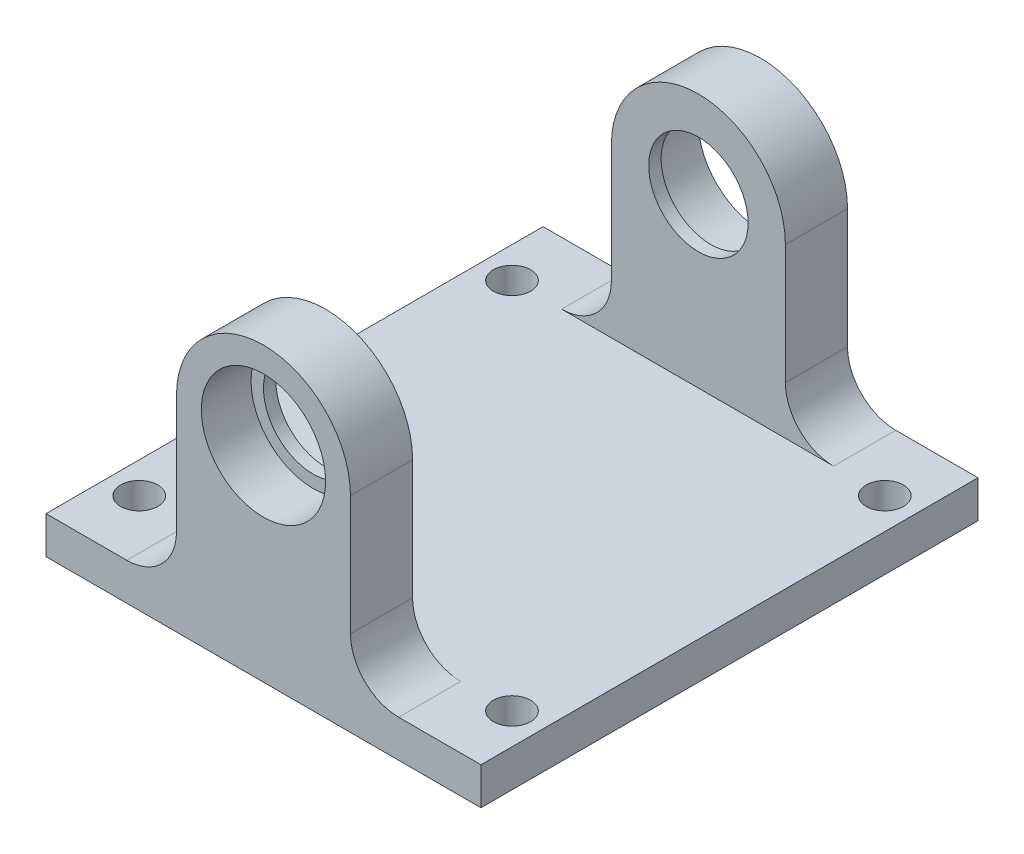
ISO-10303-21;
HEADER;
FILE_DESCRIPTION(('STEP AP214'),'2;1');
FILE_NAME('part.step','',(''),(''),'','','');
FILE_SCHEMA(('AUTOMOTIVE_DESIGN { 1 0 10303 214 1 1 1 1 }'));
ENDSEC;
DATA;
#1=APPLICATION_CONTEXT('core data for automotive mechanical design processes');
#2=APPLICATION_PROTOCOL_DEFINITION('international standard','automotive_design',2000,#1);
#3=PRODUCT_CONTEXT('',#1,'mechanical');
#4=PRODUCT('Part','Part','',(#3));
#5=PRODUCT_RELATED_PRODUCT_CATEGORY('part','',(#4));
#6=PRODUCT_DEFINITION_FORMATION('','',#4);
#7=PRODUCT_DEFINITION_CONTEXT('part definition',#1,'design');
#8=PRODUCT_DEFINITION('design','',#6,#7);
#9=PRODUCT_DEFINITION_SHAPE('','',#8);
#10=(LENGTH_UNIT() NAMED_UNIT(*) SI_UNIT(.MILLI.,.METRE.));
#11=(NAMED_UNIT(*) PLANE_ANGLE_UNIT() SI_UNIT($,.RADIAN.));
#12=(NAMED_UNIT(*) SI_UNIT($,.STERADIAN.) SOLID_ANGLE_UNIT());
#13=UNCERTAINTY_MEASURE_WITH_UNIT(LENGTH_MEASURE(1.E-05),#10,'distance_accuracy_value','');
#14=(GEOMETRIC_REPRESENTATION_CONTEXT(3) GLOBAL_UNCERTAINTY_ASSIGNED_CONTEXT((#13)) GLOBAL_UNIT_ASSIGNED_CONTEXT((#10,
#11,#12)) REPRESENTATION_CONTEXT('',''));
#15=CARTESIAN_POINT('',(0.,0.,0.));
#16=DIRECTION('',(0.,0.,1.));
#17=DIRECTION('',(1.,0.,0.));
#18=AXIS2_PLACEMENT_3D('',#15,#16,#17);
#19=CARTESIAN_POINT('',(17.5,16.5,-69.9837565929382));
#20=DIRECTION('',(0.,0.,1.));
#21=DIRECTION('',(1.,0.,0.));
#22=AXIS2_PLACEMENT_3D('',#19,#20,#21);
#23=CYLINDRICAL_SURFACE('',#22,5.);
#24=CARTESIAN_POINT('',(17.5,16.5,0.));
#25=DIRECTION('',(0.,0.,1.));
#26=DIRECTION('',(1.,0.,0.));
#27=AXIS2_PLACEMENT_3D('',#24,#25,#26);
#28=CIRCLE('',#27,5.);
#29=CARTESIAN_POINT('',(22.5,16.5,0.));
#30=VERTEX_POINT('',#29);
#31=EDGE_CURVE('E332',#30,#30,#28,.T.);
#32=ORIENTED_EDGE('',*,*,#31,.T.);
#33=EDGE_LOOP('',(#32));
#34=FACE_BOUND('',#33,.T.);
#35=CARTESIAN_POINT('',(17.5,16.5,-4.));
#36=DIRECTION('',(0.,0.,-1.));
#37=DIRECTION('',(-1.,0.,0.));
#38=AXIS2_PLACEMENT_3D('',#35,#36,#37);
#39=CIRCLE('',#38,5.);
#40=CARTESIAN_POINT('',(12.5,16.5,-4.));
#41=VERTEX_POINT('',#40);
#42=EDGE_CURVE('E11',#41,#41,#39,.F.);
#43=ORIENTED_EDGE('',*,*,#42,.F.);
#44=EDGE_LOOP('',(#43));
#45=FACE_BOUND('',#44,.T.);
#46=ADVANCED_FACE('F32',(#34,#45),#23,.F.);
#47=CARTESIAN_POINT('',(17.5,16.5,-40.));
#48=DIRECTION('',(0.,0.,1.));
#49=DIRECTION('',(1.,0.,0.));
#50=AXIS2_PLACEMENT_3D('',#47,#48,#49);
#51=CIRCLE('',#50,5.);
#52=CARTESIAN_POINT('',(22.5,16.5,-40.));
#53=VERTEX_POINT('',#52);
#54=EDGE_CURVE('E193',#53,#53,#51,.F.);
#55=ORIENTED_EDGE('',*,*,#54,.T.);
#56=EDGE_LOOP('',(#55));
#57=FACE_BOUND('',#56,.T.);
#58=CARTESIAN_POINT('',(17.5,16.5,-36.));
#59=DIRECTION('',(0.,0.,1.));
#60=DIRECTION('',(1.,0.,0.));
#61=AXIS2_PLACEMENT_3D('',#58,#59,#60);
#62=CIRCLE('',#61,5.);
#63=CARTESIAN_POINT('',(22.5,16.5,-36.));
#64=VERTEX_POINT('',#63);
#65=EDGE_CURVE('E40',#64,#64,#62,.F.);
#66=ORIENTED_EDGE('',*,*,#65,.F.);
#67=EDGE_LOOP('',(#66));
#68=FACE_BOUND('',#67,.T.);
#69=ADVANCED_FACE('F256',(#57,#68),#23,.F.);
#70=CARTESIAN_POINT('',(10.5,16.5,-69.9837565929382));
#71=DIRECTION('',(-1.,0.,0.));
#72=DIRECTION('',(0.,0.,1.));
#73=AXIS2_PLACEMENT_3D('',#70,#71,#72);
#74=PLANE('',#73);
#75=DIRECTION('',(0.,0.,1.));
#76=VECTOR('',#75,1.);
#77=CARTESIAN_POINT('',(10.5,16.5,-69.9837565929382));
#78=LINE('',#77,#76);
#79=CARTESIAN_POINT('',(10.5,16.5,-5.));
#80=VERTEX_POINT('',#79);
#81=CARTESIAN_POINT('',(10.5,16.5,0.));
#82=VERTEX_POINT('',#81);
#83=EDGE_CURVE('E192',#80,#82,#78,.T.);
#84=ORIENTED_EDGE('',*,*,#83,.F.);
#85=DIRECTION('',(0.,-1.,0.));
#86=VECTOR('',#85,1.);
#87=CARTESIAN_POINT('',(10.5,16.5,-5.));
#88=LINE('',#87,#86);
#89=CARTESIAN_POINT('',(10.5,7.00000000000003,-5.));
#90=VERTEX_POINT('',#89);
#91=EDGE_CURVE('E339',#80,#90,#88,.T.);
#92=ORIENTED_EDGE('',*,*,#91,.T.);
#93=DIRECTION('',(0.,0.,1.));
#94=VECTOR('',#93,1.);
#95=CARTESIAN_POINT('',(10.5,7.00000000000003,-69.9837565929382));
#96=LINE('',#95,#94);
#97=CARTESIAN_POINT('',(10.5,7.00000000000003,0.));
#98=VERTEX_POINT('',#97);
#99=EDGE_CURVE('E188',#90,#98,#96,.T.);
#100=ORIENTED_EDGE('',*,*,#99,.T.);
#101=DIRECTION('',(0.,-1.,0.));
#102=VECTOR('',#101,1.);
#103=CARTESIAN_POINT('',(10.5,16.5,0.));
#104=LINE('',#103,#102);
#105=EDGE_CURVE('E337',#82,#98,#104,.T.);
#106=ORIENTED_EDGE('',*,*,#105,.F.);
#107=EDGE_LOOP('',(#84,#92,#100,#106));
#108=FACE_BOUND('',#107,.T.);
#109=ADVANCED_FACE('F258',(#108),#74,.T.);
#110=CARTESIAN_POINT('',(10.5,7.00000000000003,-40.));
#111=VERTEX_POINT('',#110);
#112=CARTESIAN_POINT('',(10.5,7.00000000000003,-35.));
#113=VERTEX_POINT('',#112);
#114=EDGE_CURVE('E185',#111,#113,#96,.T.);
#115=ORIENTED_EDGE('',*,*,#114,.T.);
#116=DIRECTION('',(0.,1.,0.));
#117=VECTOR('',#116,1.);
#118=CARTESIAN_POINT('',(10.5,16.5,-35.));
#119=LINE('',#118,#117);
#120=CARTESIAN_POINT('',(10.5,16.5,-35.));
#121=VERTEX_POINT('',#120);
#122=EDGE_CURVE('E170',#113,#121,#119,.T.);
#123=ORIENTED_EDGE('',*,*,#122,.T.);
#124=CARTESIAN_POINT('',(10.5,16.5,-40.));
#125=VERTEX_POINT('',#124);
#126=EDGE_CURVE('E189',#125,#121,#78,.T.);
#127=ORIENTED_EDGE('',*,*,#126,.F.);
#128=DIRECTION('',(0.,1.,0.));
#129=VECTOR('',#128,1.);
#130=CARTESIAN_POINT('',(10.5,16.5,-40.));
#131=LINE('',#130,#129);
#132=EDGE_CURVE('E197',#111,#125,#131,.T.);
#133=ORIENTED_EDGE('',*,*,#132,.F.);
#134=EDGE_LOOP('',(#115,#123,#127,#133));
#135=FACE_BOUND('',#134,.T.);
#136=ADVANCED_FACE('F265',(#135),#74,.T.);
#137=CARTESIAN_POINT('',(6.5,7.,-69.9837565929382));
#138=DIRECTION('',(0.,0.,1.));
#139=DIRECTION('',(1.,0.,0.));
#140=AXIS2_PLACEMENT_3D('',#137,#138,#139);
#141=CYLINDRICAL_SURFACE('',#140,4.);
#142=ORIENTED_EDGE('',*,*,#99,.F.);
#143=CARTESIAN_POINT('',(6.5,7.,-5.));
#144=DIRECTION('',(0.,0.,-1.));
#145=DIRECTION('',(-1.,0.,0.));
#146=AXIS2_PLACEMENT_3D('',#143,#144,#145);
#147=CIRCLE('',#146,4.);
#148=CARTESIAN_POINT('',(6.5,3.,-5.));
#149=VERTEX_POINT('',#148);
#150=EDGE_CURVE('E334',#90,#149,#147,.T.);
#151=ORIENTED_EDGE('',*,*,#150,.T.);
#152=DIRECTION('',(0.,0.,1.));
#153=VECTOR('',#152,1.);
#154=CARTESIAN_POINT('',(6.49999999999997,3.,-69.9837565929382));
#155=LINE('',#154,#153);
#156=CARTESIAN_POINT('',(6.49999999999997,3.,0.));
#157=VERTEX_POINT('',#156);
#158=EDGE_CURVE('E55',#149,#157,#155,.T.);
#159=ORIENTED_EDGE('',*,*,#158,.T.);
#160=CARTESIAN_POINT('',(6.5,7.,0.));
#161=DIRECTION('',(0.,0.,-1.));
#162=DIRECTION('',(-1.,0.,0.));
#163=AXIS2_PLACEMENT_3D('',#160,#161,#162);
#164=CIRCLE('',#163,4.);
#165=EDGE_CURVE('E347',#98,#157,#164,.T.);
#166=ORIENTED_EDGE('',*,*,#165,.F.);
#167=EDGE_LOOP('',(#142,#151,#159,#166));
#168=FACE_BOUND('',#167,.T.);
#169=ADVANCED_FACE('F283',(#168),#141,.F.);
#170=CARTESIAN_POINT('',(6.49999999999997,3.,-40.));
#171=VERTEX_POINT('',#170);
#172=CARTESIAN_POINT('',(6.5,3.,-35.));
#173=VERTEX_POINT('',#172);
#174=EDGE_CURVE('E181',#171,#173,#155,.T.);
#175=ORIENTED_EDGE('',*,*,#174,.T.);
#176=CARTESIAN_POINT('',(6.5,7.,-35.));
#177=DIRECTION('',(0.,0.,1.));
#178=DIRECTION('',(1.,0.,0.));
#179=AXIS2_PLACEMENT_3D('',#176,#177,#178);
#180=CIRCLE('',#179,4.);
#181=EDGE_CURVE('E155',#173,#113,#180,.T.);
#182=ORIENTED_EDGE('',*,*,#181,.T.);
#183=ORIENTED_EDGE('',*,*,#114,.F.);
#184=CARTESIAN_POINT('',(6.5,7.,-40.));
#185=DIRECTION('',(0.,0.,1.));
#186=DIRECTION('',(1.,0.,0.));
#187=AXIS2_PLACEMENT_3D('',#184,#185,#186);
#188=CIRCLE('',#187,4.);
#189=EDGE_CURVE('E357',#171,#111,#188,.T.);
#190=ORIENTED_EDGE('',*,*,#189,.F.);
#191=EDGE_LOOP('',(#175,#182,#183,#190));
#192=FACE_BOUND('',#191,.T.);
#193=ADVANCED_FACE('F281',(#192),#141,.F.);
#194=CARTESIAN_POINT('',(28.3809428367373,6.88094283673729,-69.9837565929382));
#195=DIRECTION('',(0.,0.,1.));
#196=DIRECTION('',(1.,0.,0.));
#197=AXIS2_PLACEMENT_3D('',#194,#195,#196);
#198=CYLINDRICAL_SURFACE('',#197,3.8809428367373);
#199=DIRECTION('',(0.,0.,1.));
#200=VECTOR('',#199,1.);
#201=CARTESIAN_POINT('',(28.3809428367373,3.,-69.9837565929382));
#202=LINE('',#201,#200);
#203=CARTESIAN_POINT('',(28.3809428367373,3.,-5.));
#204=VERTEX_POINT('',#203);
#205=CARTESIAN_POINT('',(28.3809428367373,3.,0.));
#206=VERTEX_POINT('',#205);
#207=EDGE_CURVE('E47',#204,#206,#202,.T.);
#208=ORIENTED_EDGE('',*,*,#207,.F.);
#209=CARTESIAN_POINT('',(28.3809428367373,6.88094283673729,-5.));
#210=DIRECTION('',(0.,0.,-1.));
#211=DIRECTION('',(-1.,0.,0.));
#212=AXIS2_PLACEMENT_3D('',#209,#210,#211);
#213=CIRCLE('',#212,3.8809428367373);
#214=CARTESIAN_POINT('',(24.5,6.88094283673732,-5.));
#215=VERTEX_POINT('',#214);
#216=EDGE_CURVE('E374',#204,#215,#213,.T.);
#217=ORIENTED_EDGE('',*,*,#216,.T.);
#218=DIRECTION('',(0.,0.,1.));
#219=VECTOR('',#218,1.);
#220=CARTESIAN_POINT('',(24.5,6.88094283673732,-69.9837565929382));
#221=LINE('',#220,#219);
#222=CARTESIAN_POINT('',(24.5,6.88094283673732,0.));
#223=VERTEX_POINT('',#222);
#224=EDGE_CURVE('E178',#215,#223,#221,.T.);
#225=ORIENTED_EDGE('',*,*,#224,.T.);
#226=CARTESIAN_POINT('',(28.3809428367373,6.88094283673729,0.));
#227=DIRECTION('',(0.,0.,-1.));
#228=DIRECTION('',(1.,0.,0.));
#229=AXIS2_PLACEMENT_3D('',#226,#227,#228);
#230=CIRCLE('',#229,3.8809428367373);
#231=EDGE_CURVE('E350',#206,#223,#230,.T.);
#232=ORIENTED_EDGE('',*,*,#231,.F.);
#233=EDGE_LOOP('',(#208,#217,#225,#232));
#234=FACE_BOUND('',#233,.T.);
#235=ADVANCED_FACE('F278',(#234),#198,.F.);
#236=CARTESIAN_POINT('',(24.5,6.88094283673732,-40.));
#237=VERTEX_POINT('',#236);
#238=CARTESIAN_POINT('',(24.5,6.88094283673732,-35.));
#239=VERTEX_POINT('',#238);
#240=EDGE_CURVE('E169',#237,#239,#221,.T.);
#241=ORIENTED_EDGE('',*,*,#240,.T.);
#242=CARTESIAN_POINT('',(28.3809428367373,6.88094283673729,-35.));
#243=DIRECTION('',(0.,0.,1.));
#244=DIRECTION('',(1.,0.,0.));
#245=AXIS2_PLACEMENT_3D('',#242,#243,#244);
#246=CIRCLE('',#245,3.8809428367373);
#247=CARTESIAN_POINT('',(28.3809428367373,3.,-35.));
#248=VERTEX_POINT('',#247);
#249=EDGE_CURVE('E152',#239,#248,#246,.T.);
#250=ORIENTED_EDGE('',*,*,#249,.T.);
#251=CARTESIAN_POINT('',(28.3809428367373,3.,-40.));
#252=VERTEX_POINT('',#251);
#253=EDGE_CURVE('E167',#252,#248,#202,.T.);
#254=ORIENTED_EDGE('',*,*,#253,.F.);
#255=CARTESIAN_POINT('',(28.3809428367373,6.88094283673729,-40.));
#256=DIRECTION('',(0.,0.,1.));
#257=DIRECTION('',(1.,0.,0.));
#258=AXIS2_PLACEMENT_3D('',#255,#256,#257);
#259=CIRCLE('',#258,3.8809428367373);
#260=EDGE_CURVE('E362',#237,#252,#259,.T.);
#261=ORIENTED_EDGE('',*,*,#260,.F.);
#262=EDGE_LOOP('',(#241,#250,#254,#261));
#263=FACE_BOUND('',#262,.T.);
#264=ADVANCED_FACE('F165',(#263),#198,.F.);
#265=CARTESIAN_POINT('',(24.5,16.5,-69.9837565929382));
#266=DIRECTION('',(1.,0.,0.));
#267=DIRECTION('',(0.,0.,-1.));
#268=AXIS2_PLACEMENT_3D('',#265,#266,#267);
#269=PLANE('',#268);
#270=ORIENTED_EDGE('',*,*,#224,.F.);
#271=DIRECTION('',(0.,1.,0.));
#272=VECTOR('',#271,1.);
#273=CARTESIAN_POINT('',(24.5,16.5,-5.));
#274=LINE('',#273,#272);
#275=CARTESIAN_POINT('',(24.5,16.5,-5.));
#276=VERTEX_POINT('',#275);
#277=EDGE_CURVE('E369',#215,#276,#274,.T.);
#278=ORIENTED_EDGE('',*,*,#277,.T.);
#279=DIRECTION('',(0.,0.,1.));
#280=VECTOR('',#279,1.);
#281=CARTESIAN_POINT('',(24.5,16.5,-69.9837565929382));
#282=LINE('',#281,#280);
#283=CARTESIAN_POINT('',(24.5,16.5,0.));
#284=VERTEX_POINT('',#283);
#285=EDGE_CURVE('E358',#276,#284,#282,.T.);
#286=ORIENTED_EDGE('',*,*,#285,.T.);
#287=DIRECTION('',(0.,1.,0.));
#288=VECTOR('',#287,1.);
#289=CARTESIAN_POINT('',(24.5,16.5,0.));
#290=LINE('',#289,#288);
#291=EDGE_CURVE('E353',#223,#284,#290,.T.);
#292=ORIENTED_EDGE('',*,*,#291,.F.);
#293=EDGE_LOOP('',(#270,#278,#286,#292));
#294=FACE_BOUND('',#293,.T.);
#295=ADVANCED_FACE('F273',(#294),#269,.T.);
#296=CARTESIAN_POINT('',(24.5,16.5,-40.));
#297=VERTEX_POINT('',#296);
#298=CARTESIAN_POINT('',(24.5,16.5,-35.));
#299=VERTEX_POINT('',#298);
#300=EDGE_CURVE('E355',#297,#299,#282,.T.);
#301=ORIENTED_EDGE('',*,*,#300,.T.);
#302=DIRECTION('',(0.,-1.,0.));
#303=VECTOR('',#302,1.);
#304=CARTESIAN_POINT('',(24.5,16.5,-35.));
#305=LINE('',#304,#303);
#306=EDGE_CURVE('E171',#299,#239,#305,.T.);
#307=ORIENTED_EDGE('',*,*,#306,.T.);
#308=ORIENTED_EDGE('',*,*,#240,.F.);
#309=DIRECTION('',(0.,-1.,0.));
#310=VECTOR('',#309,1.);
#311=CARTESIAN_POINT('',(24.5,16.5,-40.));
#312=LINE('',#311,#310);
#313=EDGE_CURVE('E384',#297,#237,#312,.T.);
#314=ORIENTED_EDGE('',*,*,#313,.F.);
#315=EDGE_LOOP('',(#301,#307,#308,#314));
#316=FACE_BOUND('',#315,.T.);
#317=ADVANCED_FACE('F276',(#316),#269,.T.);
#318=CARTESIAN_POINT('',(17.5,16.5,-69.9837565929382));
#319=DIRECTION('',(0.,0.,1.));
#320=DIRECTION('',(1.,0.,0.));
#321=AXIS2_PLACEMENT_3D('',#318,#319,#320);
#322=CYLINDRICAL_SURFACE('',#321,7.);
#323=CARTESIAN_POINT('',(17.5,16.5,-5.));
#324=DIRECTION('',(0.,0.,-1.));
#325=DIRECTION('',(-1.,0.,0.));
#326=AXIS2_PLACEMENT_3D('',#323,#324,#325);
#327=CIRCLE('',#326,7.);
#328=EDGE_CURVE('E379',#276,#80,#327,.F.);
#329=ORIENTED_EDGE('',*,*,#328,.T.);
#330=ORIENTED_EDGE('',*,*,#83,.T.);
#331=CARTESIAN_POINT('',(17.5,16.5,0.));
#332=DIRECTION('',(0.,0.,1.));
#333=DIRECTION('',(1.,0.,0.));
#334=AXIS2_PLACEMENT_3D('',#331,#332,#333);
#335=CIRCLE('',#334,7.);
#336=EDGE_CURVE('E333',#284,#82,#335,.T.);
#337=ORIENTED_EDGE('',*,*,#336,.F.);
#338=ORIENTED_EDGE('',*,*,#285,.F.);
#339=EDGE_LOOP('',(#329,#330,#337,#338));
#340=FACE_BOUND('',#339,.T.);
#341=ADVANCED_FACE('F286',(#340),#322,.T.);
#342=CARTESIAN_POINT('',(17.5,16.5,-35.));
#343=DIRECTION('',(0.,0.,1.));
#344=DIRECTION('',(1.,0.,0.));
#345=AXIS2_PLACEMENT_3D('',#342,#343,#344);
#346=CIRCLE('',#345,7.);
#347=EDGE_CURVE('E159',#121,#299,#346,.F.);
#348=ORIENTED_EDGE('',*,*,#347,.T.);
#349=ORIENTED_EDGE('',*,*,#300,.F.);
#350=CARTESIAN_POINT('',(17.5,16.5,-40.));
#351=DIRECTION('',(0.,0.,1.));
#352=DIRECTION('',(1.,0.,0.));
#353=AXIS2_PLACEMENT_3D('',#350,#351,#352);
#354=CIRCLE('',#353,7.);
#355=EDGE_CURVE('E342',#125,#297,#354,.F.);
#356=ORIENTED_EDGE('',*,*,#355,.F.);
#357=ORIENTED_EDGE('',*,*,#126,.T.);
#358=EDGE_LOOP('',(#348,#349,#356,#357));
#359=FACE_BOUND('',#358,.T.);
#360=ADVANCED_FACE('F289',(#359),#322,.T.);
#361=CARTESIAN_POINT('',(0.,3.,0.));
#362=DIRECTION('',(0.,-1.,0.));
#363=DIRECTION('',(0.,0.,-1.));
#364=AXIS2_PLACEMENT_3D('',#361,#362,#363);
#365=PLANE('',#364);
#366=CARTESIAN_POINT('',(32.5000000000003,3.,-5.));
#367=DIRECTION('',(0.,1.,0.));
#368=DIRECTION('',(0.,0.,1.));
#369=AXIS2_PLACEMENT_3D('',#366,#367,#368);
#370=CIRCLE('',#369,1.5);
#371=CARTESIAN_POINT('',(32.5000000000003,3.,-3.5));
#372=VERTEX_POINT('',#371);
#373=EDGE_CURVE('E204',#372,#372,#370,.T.);
#374=ORIENTED_EDGE('',*,*,#373,.F.);
#375=EDGE_LOOP('',(#374));
#376=FACE_BOUND('',#375,.T.);
#377=CARTESIAN_POINT('',(32.5,3.,-35.));
#378=DIRECTION('',(0.,1.,0.));
#379=DIRECTION('',(0.,0.,1.));
#380=AXIS2_PLACEMENT_3D('',#377,#378,#379);
#381=CIRCLE('',#380,1.5);
#382=CARTESIAN_POINT('',(32.5,3.,-33.5));
#383=VERTEX_POINT('',#382);
#384=EDGE_CURVE('E210',#383,#383,#381,.T.);
#385=ORIENTED_EDGE('',*,*,#384,.F.);
#386=EDGE_LOOP('',(#385));
#387=FACE_BOUND('',#386,.T.);
#388=CARTESIAN_POINT('',(2.50000000000031,3.,-5.));
#389=DIRECTION('',(0.,1.,0.));
#390=DIRECTION('',(0.,0.,1.));
#391=AXIS2_PLACEMENT_3D('',#388,#389,#390);
#392=CIRCLE('',#391,1.5);
#393=CARTESIAN_POINT('',(2.50000000000031,3.,-3.5));
#394=VERTEX_POINT('',#393);
#395=EDGE_CURVE('E198',#394,#394,#392,.T.);
#396=ORIENTED_EDGE('',*,*,#395,.F.);
#397=EDGE_LOOP('',(#396));
#398=FACE_BOUND('',#397,.T.);
#399=ORIENTED_EDGE('',*,*,#158,.F.);
#400=DIRECTION('',(1.,0.,0.));
#401=VECTOR('',#400,1.);
#402=CARTESIAN_POINT('',(4.,3.,-5.));
#403=LINE('',#402,#401);
#404=EDGE_CURVE('E160',#149,#204,#403,.T.);
#405=ORIENTED_EDGE('',*,*,#404,.T.);
#406=ORIENTED_EDGE('',*,*,#207,.T.);
#407=DIRECTION('',(1.,0.,0.));
#408=VECTOR('',#407,1.);
#409=CARTESIAN_POINT('',(0.,3.,0.));
#410=LINE('',#409,#408);
#411=CARTESIAN_POINT('',(35.,3.,0.));
#412=VERTEX_POINT('',#411);
#413=EDGE_CURVE('E225',#206,#412,#410,.T.);
#414=ORIENTED_EDGE('',*,*,#413,.T.);
#415=DIRECTION('',(0.,0.,-1.));
#416=VECTOR('',#415,1.);
#417=CARTESIAN_POINT('',(35.,3.,0.));
#418=LINE('',#417,#416);
#419=CARTESIAN_POINT('',(35.,3.,-40.));
#420=VERTEX_POINT('',#419);
#421=EDGE_CURVE('E229',#412,#420,#418,.T.);
#422=ORIENTED_EDGE('',*,*,#421,.T.);
#423=DIRECTION('',(-1.,0.,0.));
#424=VECTOR('',#423,1.);
#425=CARTESIAN_POINT('',(0.,3.,-40.));
#426=LINE('',#425,#424);
#427=EDGE_CURVE('E176',#420,#252,#426,.T.);
#428=ORIENTED_EDGE('',*,*,#427,.T.);
#429=ORIENTED_EDGE('',*,*,#253,.T.);
#430=DIRECTION('',(-1.,0.,0.));
#431=VECTOR('',#430,1.);
#432=CARTESIAN_POINT('',(31.,3.,-35.));
#433=LINE('',#432,#431);
#434=EDGE_CURVE('E147',#248,#173,#433,.T.);
#435=ORIENTED_EDGE('',*,*,#434,.T.);
#436=ORIENTED_EDGE('',*,*,#174,.F.);
#437=CARTESIAN_POINT('',(0.,3.,-40.));
#438=VERTEX_POINT('',#437);
#439=EDGE_CURVE('E231',#171,#438,#426,.T.);
#440=ORIENTED_EDGE('',*,*,#439,.T.);
#441=DIRECTION('',(0.,0.,1.));
#442=VECTOR('',#441,1.);
#443=CARTESIAN_POINT('',(0.,3.,0.));
#444=LINE('',#443,#442);
#445=CARTESIAN_POINT('',(0.,3.,0.));
#446=VERTEX_POINT('',#445);
#447=EDGE_CURVE('E222',#438,#446,#444,.T.);
#448=ORIENTED_EDGE('',*,*,#447,.T.);
#449=EDGE_CURVE('E227',#446,#157,#410,.T.);
#450=ORIENTED_EDGE('',*,*,#449,.T.);
#451=EDGE_LOOP('',(#399,#405,#406,#414,#422,#428,#429,#435,#436,#440,#448,#450));
#452=FACE_BOUND('',#451,.T.);
#453=CARTESIAN_POINT('',(2.5,3.,-35.));
#454=DIRECTION('',(0.,1.,0.));
#455=DIRECTION('',(0.,0.,1.));
#456=AXIS2_PLACEMENT_3D('',#453,#454,#455);
#457=CIRCLE('',#456,1.5);
#458=CARTESIAN_POINT('',(2.5,3.,-33.5));
#459=VERTEX_POINT('',#458);
#460=EDGE_CURVE('E216',#459,#459,#457,.T.);
#461=ORIENTED_EDGE('',*,*,#460,.F.);
#462=EDGE_LOOP('',(#461));
#463=FACE_BOUND('',#462,.T.);
#464=ADVANCED_FACE('F173',(#376,#387,#398,#452,#463),#365,.F.);
#465=CARTESIAN_POINT('',(0.,0.,0.));
#466=DIRECTION('',(0.,-1.,0.));
#467=DIRECTION('',(0.,0.,-1.));
#468=AXIS2_PLACEMENT_3D('',#465,#466,#467);
#469=PLANE('',#468);
#470=CARTESIAN_POINT('',(32.5000000000003,0.,-5.));
#471=DIRECTION('',(0.,1.,0.));
#472=DIRECTION('',(0.,0.,1.));
#473=AXIS2_PLACEMENT_3D('',#470,#471,#472);
#474=CIRCLE('',#473,1.5);
#475=CARTESIAN_POINT('',(32.5000000000003,0.,-3.5));
#476=VERTEX_POINT('',#475);
#477=EDGE_CURVE('E201',#476,#476,#474,.T.);
#478=ORIENTED_EDGE('',*,*,#477,.T.);
#479=EDGE_LOOP('',(#478));
#480=FACE_BOUND('',#479,.T.);
#481=CARTESIAN_POINT('',(2.5,0.,-35.));
#482=DIRECTION('',(0.,1.,0.));
#483=DIRECTION('',(0.,0.,1.));
#484=AXIS2_PLACEMENT_3D('',#481,#482,#483);
#485=CIRCLE('',#484,1.5);
#486=CARTESIAN_POINT('',(2.5,0.,-33.5));
#487=VERTEX_POINT('',#486);
#488=EDGE_CURVE('E213',#487,#487,#485,.T.);
#489=ORIENTED_EDGE('',*,*,#488,.T.);
#490=EDGE_LOOP('',(#489));
#491=FACE_BOUND('',#490,.T.);
#492=DIRECTION('',(0.,0.,1.));
#493=VECTOR('',#492,1.);
#494=CARTESIAN_POINT('',(0.,0.,0.));
#495=LINE('',#494,#493);
#496=CARTESIAN_POINT('',(0.,0.,-40.));
#497=VERTEX_POINT('',#496);
#498=CARTESIAN_POINT('',(0.,0.,0.));
#499=VERTEX_POINT('',#498);
#500=EDGE_CURVE('E219',#497,#499,#495,.T.);
#501=ORIENTED_EDGE('',*,*,#500,.F.);
#502=DIRECTION('',(-1.,0.,0.));
#503=VECTOR('',#502,1.);
#504=CARTESIAN_POINT('',(0.,0.,-40.));
#505=LINE('',#504,#503);
#506=CARTESIAN_POINT('',(35.,0.,-40.));
#507=VERTEX_POINT('',#506);
#508=EDGE_CURVE('E226',#507,#497,#505,.T.);
#509=ORIENTED_EDGE('',*,*,#508,.F.);
#510=DIRECTION('',(0.,0.,-1.));
#511=VECTOR('',#510,1.);
#512=CARTESIAN_POINT('',(35.,0.,0.));
#513=LINE('',#512,#511);
#514=CARTESIAN_POINT('',(35.,0.,0.));
#515=VERTEX_POINT('',#514);
#516=EDGE_CURVE('E238',#515,#507,#513,.T.);
#517=ORIENTED_EDGE('',*,*,#516,.F.);
#518=DIRECTION('',(1.,0.,0.));
#519=VECTOR('',#518,1.);
#520=CARTESIAN_POINT('',(0.,0.,0.));
#521=LINE('',#520,#519);
#522=EDGE_CURVE('E236',#499,#515,#521,.T.);
#523=ORIENTED_EDGE('',*,*,#522,.F.);
#524=EDGE_LOOP('',(#501,#509,#517,#523));
#525=FACE_BOUND('',#524,.T.);
#526=CARTESIAN_POINT('',(32.5,0.,-35.));
#527=DIRECTION('',(0.,1.,0.));
#528=DIRECTION('',(0.,0.,1.));
#529=AXIS2_PLACEMENT_3D('',#526,#527,#528);
#530=CIRCLE('',#529,1.5);
#531=CARTESIAN_POINT('',(32.5,0.,-33.5));
#532=VERTEX_POINT('',#531);
#533=EDGE_CURVE('E207',#532,#532,#530,.T.);
#534=ORIENTED_EDGE('',*,*,#533,.T.);
#535=EDGE_LOOP('',(#534));
#536=FACE_BOUND('',#535,.T.);
#537=CARTESIAN_POINT('',(2.50000000000031,0.,-5.));
#538=DIRECTION('',(0.,1.,0.));
#539=DIRECTION('',(0.,0.,1.));
#540=AXIS2_PLACEMENT_3D('',#537,#538,#539);
#541=CIRCLE('',#540,1.5);
#542=CARTESIAN_POINT('',(2.50000000000031,0.,-3.5));
#543=VERTEX_POINT('',#542);
#544=EDGE_CURVE('E196',#543,#543,#541,.T.);
#545=ORIENTED_EDGE('',*,*,#544,.T.);
#546=EDGE_LOOP('',(#545));
#547=FACE_BOUND('',#546,.T.);
#548=ADVANCED_FACE('F310',(#480,#491,#525,#536,#547),#469,.T.);
#549=CARTESIAN_POINT('',(0.,3.,0.));
#550=DIRECTION('',(1.,0.,0.));
#551=DIRECTION('',(0.,0.,-1.));
#552=AXIS2_PLACEMENT_3D('',#549,#550,#551);
#553=PLANE('',#552);
#554=ORIENTED_EDGE('',*,*,#500,.T.);
#555=DIRECTION('',(0.,-1.,0.));
#556=VECTOR('',#555,1.);
#557=CARTESIAN_POINT('',(0.,3.,0.));
#558=LINE('',#557,#556);
#559=EDGE_CURVE('E249',#446,#499,#558,.T.);
#560=ORIENTED_EDGE('',*,*,#559,.F.);
#561=ORIENTED_EDGE('',*,*,#447,.F.);
#562=DIRECTION('',(0.,-1.,0.));
#563=VECTOR('',#562,1.);
#564=CARTESIAN_POINT('',(0.,3.,-40.));
#565=LINE('',#564,#563);
#566=EDGE_CURVE('E233',#438,#497,#565,.T.);
#567=ORIENTED_EDGE('',*,*,#566,.T.);
#568=EDGE_LOOP('',(#554,#560,#561,#567));
#569=FACE_BOUND('',#568,.T.);
#570=ADVANCED_FACE('F34',(#569),#553,.F.);
#571=CARTESIAN_POINT('',(0.,3.,0.));
#572=DIRECTION('',(0.,0.,-1.));
#573=DIRECTION('',(-1.,0.,0.));
#574=AXIS2_PLACEMENT_3D('',#571,#572,#573);
#575=PLANE('',#574);
#576=ORIENTED_EDGE('',*,*,#522,.T.);
#577=DIRECTION('',(0.,-1.,0.));
#578=VECTOR('',#577,1.);
#579=CARTESIAN_POINT('',(35.,3.,0.));
#580=LINE('',#579,#578);
#581=EDGE_CURVE('E246',#412,#515,#580,.T.);
#582=ORIENTED_EDGE('',*,*,#581,.F.);
#583=ORIENTED_EDGE('',*,*,#413,.F.);
#584=ORIENTED_EDGE('',*,*,#231,.T.);
#585=ORIENTED_EDGE('',*,*,#291,.T.);
#586=ORIENTED_EDGE('',*,*,#336,.T.);
#587=ORIENTED_EDGE('',*,*,#105,.T.);
#588=ORIENTED_EDGE('',*,*,#165,.T.);
#589=ORIENTED_EDGE('',*,*,#449,.F.);
#590=ORIENTED_EDGE('',*,*,#559,.T.);
#591=EDGE_LOOP('',(#576,#582,#583,#584,#585,#586,#587,#588,#589,#590));
#592=FACE_BOUND('',#591,.T.);
#593=ORIENTED_EDGE('',*,*,#31,.F.);
#594=EDGE_LOOP('',(#593));
#595=FACE_BOUND('',#594,.T.);
#596=ADVANCED_FACE('F320',(#592,#595),#575,.F.);
#597=CARTESIAN_POINT('',(35.,3.,0.));
#598=DIRECTION('',(-1.,0.,0.));
#599=DIRECTION('',(0.,0.,1.));
#600=AXIS2_PLACEMENT_3D('',#597,#598,#599);
#601=PLANE('',#600);
#602=ORIENTED_EDGE('',*,*,#516,.T.);
#603=DIRECTION('',(0.,-1.,0.));
#604=VECTOR('',#603,1.);
#605=CARTESIAN_POINT('',(35.,3.,-40.));
#606=LINE('',#605,#604);
#607=EDGE_CURVE('E243',#420,#507,#606,.T.);
#608=ORIENTED_EDGE('',*,*,#607,.F.);
#609=ORIENTED_EDGE('',*,*,#421,.F.);
#610=ORIENTED_EDGE('',*,*,#581,.T.);
#611=EDGE_LOOP('',(#602,#608,#609,#610));
#612=FACE_BOUND('',#611,.T.);
#613=ADVANCED_FACE('F317',(#612),#601,.F.);
#614=CARTESIAN_POINT('',(0.,3.,-40.));
#615=DIRECTION('',(0.,0.,1.));
#616=DIRECTION('',(1.,0.,0.));
#617=AXIS2_PLACEMENT_3D('',#614,#615,#616);
#618=PLANE('',#617);
#619=ORIENTED_EDGE('',*,*,#508,.T.);
#620=ORIENTED_EDGE('',*,*,#566,.F.);
#621=ORIENTED_EDGE('',*,*,#439,.F.);
#622=ORIENTED_EDGE('',*,*,#189,.T.);
#623=ORIENTED_EDGE('',*,*,#132,.T.);
#624=ORIENTED_EDGE('',*,*,#355,.T.);
#625=ORIENTED_EDGE('',*,*,#313,.T.);
#626=ORIENTED_EDGE('',*,*,#260,.T.);
#627=ORIENTED_EDGE('',*,*,#427,.F.);
#628=ORIENTED_EDGE('',*,*,#607,.T.);
#629=EDGE_LOOP('',(#619,#620,#621,#622,#623,#624,#625,#626,#627,#628));
#630=FACE_BOUND('',#629,.T.);
#631=ORIENTED_EDGE('',*,*,#54,.F.);
#632=EDGE_LOOP('',(#631));
#633=FACE_BOUND('',#632,.T.);
#634=ADVANCED_FACE('F306',(#630,#633),#618,.F.);
#635=CARTESIAN_POINT('',(2.5,3.,-35.));
#636=DIRECTION('',(0.,-1.,0.));
#637=DIRECTION('',(0.,0.,-1.));
#638=AXIS2_PLACEMENT_3D('',#635,#636,#637);
#639=CYLINDRICAL_SURFACE('',#638,1.5);
#640=ORIENTED_EDGE('',*,*,#460,.T.);
#641=EDGE_LOOP('',(#640));
#642=FACE_BOUND('',#641,.T.);
#643=ORIENTED_EDGE('',*,*,#488,.F.);
#644=EDGE_LOOP('',(#643));
#645=FACE_BOUND('',#644,.T.);
#646=ADVANCED_FACE('F302',(#642,#645),#639,.F.);
#647=CARTESIAN_POINT('',(32.5,3.,-35.));
#648=DIRECTION('',(0.,-1.,0.));
#649=DIRECTION('',(0.,0.,-1.));
#650=AXIS2_PLACEMENT_3D('',#647,#648,#649);
#651=CYLINDRICAL_SURFACE('',#650,1.5);
#652=ORIENTED_EDGE('',*,*,#384,.T.);
#653=EDGE_LOOP('',(#652));
#654=FACE_BOUND('',#653,.T.);
#655=ORIENTED_EDGE('',*,*,#533,.F.);
#656=EDGE_LOOP('',(#655));
#657=FACE_BOUND('',#656,.T.);
#658=ADVANCED_FACE('F298',(#654,#657),#651,.F.);
#659=CARTESIAN_POINT('',(32.5000000000003,3.,-5.));
#660=DIRECTION('',(0.,-1.,0.));
#661=DIRECTION('',(0.,0.,-1.));
#662=AXIS2_PLACEMENT_3D('',#659,#660,#661);
#663=CYLINDRICAL_SURFACE('',#662,1.5);
#664=ORIENTED_EDGE('',*,*,#373,.T.);
#665=EDGE_LOOP('',(#664));
#666=FACE_BOUND('',#665,.T.);
#667=ORIENTED_EDGE('',*,*,#477,.F.);
#668=EDGE_LOOP('',(#667));
#669=FACE_BOUND('',#668,.T.);
#670=ADVANCED_FACE('F294',(#666,#669),#663,.F.);
#671=CARTESIAN_POINT('',(2.50000000000031,3.,-5.));
#672=DIRECTION('',(0.,-1.,0.));
#673=DIRECTION('',(0.,0.,-1.));
#674=AXIS2_PLACEMENT_3D('',#671,#672,#673);
#675=CYLINDRICAL_SURFACE('',#674,1.5);
#676=ORIENTED_EDGE('',*,*,#395,.T.);
#677=EDGE_LOOP('',(#676));
#678=FACE_BOUND('',#677,.T.);
#679=ORIENTED_EDGE('',*,*,#544,.F.);
#680=EDGE_LOOP('',(#679));
#681=FACE_BOUND('',#680,.T.);
#682=ADVANCED_FACE('F291',(#678,#681),#675,.F.);
#683=CARTESIAN_POINT('',(4.,23.5,-5.));
#684=DIRECTION('',(0.,0.,-1.));
#685=DIRECTION('',(-1.,0.,0.));
#686=AXIS2_PLACEMENT_3D('',#683,#684,#685);
#687=PLANE('',#686);
#688=ORIENTED_EDGE('',*,*,#91,.F.);
#689=ORIENTED_EDGE('',*,*,#328,.F.);
#690=ORIENTED_EDGE('',*,*,#277,.F.);
#691=ORIENTED_EDGE('',*,*,#216,.F.);
#692=ORIENTED_EDGE('',*,*,#404,.F.);
#693=ORIENTED_EDGE('',*,*,#150,.F.);
#694=EDGE_LOOP('',(#688,#689,#690,#691,#692,#693));
#695=FACE_BOUND('',#694,.T.);
#696=CARTESIAN_POINT('',(17.5,16.5,-5.));
#697=DIRECTION('',(0.,0.,-1.));
#698=DIRECTION('',(-1.,0.,0.));
#699=AXIS2_PLACEMENT_3D('',#696,#697,#698);
#700=CIRCLE('',#699,4.);
#701=CARTESIAN_POINT('',(13.5,16.5,-5.));
#702=VERTEX_POINT('',#701);
#703=EDGE_CURVE('E578',#702,#702,#700,.T.);
#704=ORIENTED_EDGE('',*,*,#703,.F.);
#705=EDGE_LOOP('',(#704));
#706=FACE_BOUND('',#705,.T.);
#707=ADVANCED_FACE('F271',(#695,#706),#687,.T.);
#708=CARTESIAN_POINT('',(31.,23.5,-35.));
#709=DIRECTION('',(0.,0.,1.));
#710=DIRECTION('',(1.,0.,0.));
#711=AXIS2_PLACEMENT_3D('',#708,#709,#710);
#712=PLANE('',#711);
#713=ORIENTED_EDGE('',*,*,#434,.F.);
#714=ORIENTED_EDGE('',*,*,#249,.F.);
#715=ORIENTED_EDGE('',*,*,#306,.F.);
#716=ORIENTED_EDGE('',*,*,#347,.F.);
#717=ORIENTED_EDGE('',*,*,#122,.F.);
#718=ORIENTED_EDGE('',*,*,#181,.F.);
#719=EDGE_LOOP('',(#713,#714,#715,#716,#717,#718));
#720=FACE_BOUND('',#719,.T.);
#721=CARTESIAN_POINT('',(17.5,16.5,-35.));
#722=DIRECTION('',(0.,0.,1.));
#723=DIRECTION('',(1.,0.,0.));
#724=AXIS2_PLACEMENT_3D('',#721,#722,#723);
#725=CIRCLE('',#724,4.);
#726=CARTESIAN_POINT('',(21.5,16.5,-35.));
#727=VERTEX_POINT('',#726);
#728=EDGE_CURVE('E580',#727,#727,#725,.T.);
#729=ORIENTED_EDGE('',*,*,#728,.F.);
#730=EDGE_LOOP('',(#729));
#731=FACE_BOUND('',#730,.T.);
#732=ADVANCED_FACE('F149',(#720,#731),#712,.T.);
#733=CARTESIAN_POINT('',(17.5,16.5,-36.));
#734=DIRECTION('',(0.,0.,1.));
#735=DIRECTION('',(1.,0.,0.));
#736=AXIS2_PLACEMENT_3D('',#733,#734,#735);
#737=PLANE('',#736);
#738=CARTESIAN_POINT('',(17.5,16.5,-36.));
#739=DIRECTION('',(0.,0.,1.));
#740=DIRECTION('',(1.,0.,0.));
#741=AXIS2_PLACEMENT_3D('',#738,#739,#740);
#742=CIRCLE('',#741,4.);
#743=CARTESIAN_POINT('',(21.5,16.5,-36.));
#744=VERTEX_POINT('',#743);
#745=EDGE_CURVE('E583',#744,#744,#742,.T.);
#746=ORIENTED_EDGE('',*,*,#745,.T.);
#747=EDGE_LOOP('',(#746));
#748=FACE_BOUND('',#747,.T.);
#749=ORIENTED_EDGE('',*,*,#65,.T.);
#750=EDGE_LOOP('',(#749));
#751=FACE_BOUND('',#750,.T.);
#752=ADVANCED_FACE('F254',(#748,#751),#737,.F.);
#753=CARTESIAN_POINT('',(17.5,16.5,-36.));
#754=DIRECTION('',(0.,0.,1.));
#755=DIRECTION('',(1.,0.,0.));
#756=AXIS2_PLACEMENT_3D('',#753,#754,#755);
#757=CYLINDRICAL_SURFACE('',#756,4.);
#758=ORIENTED_EDGE('',*,*,#745,.F.);
#759=EDGE_LOOP('',(#758));
#760=FACE_BOUND('',#759,.T.);
#761=ORIENTED_EDGE('',*,*,#728,.T.);
#762=EDGE_LOOP('',(#761));
#763=FACE_BOUND('',#762,.T.);
#764=ADVANCED_FACE('F532',(#760,#763),#757,.F.);
#765=CARTESIAN_POINT('',(17.5,16.5,-4.));
#766=DIRECTION('',(0.,0.,-1.));
#767=DIRECTION('',(-1.,0.,0.));
#768=AXIS2_PLACEMENT_3D('',#765,#766,#767);
#769=PLANE('',#768);
#770=CARTESIAN_POINT('',(17.5,16.5,-4.));
#771=DIRECTION('',(0.,0.,-1.));
#772=DIRECTION('',(-1.,0.,0.));
#773=AXIS2_PLACEMENT_3D('',#770,#771,#772);
#774=CIRCLE('',#773,4.);
#775=CARTESIAN_POINT('',(13.5,16.5,-4.));
#776=VERTEX_POINT('',#775);
#777=EDGE_CURVE('E575',#776,#776,#774,.T.);
#778=ORIENTED_EDGE('',*,*,#777,.T.);
#779=EDGE_LOOP('',(#778));
#780=FACE_BOUND('',#779,.T.);
#781=ORIENTED_EDGE('',*,*,#42,.T.);
#782=EDGE_LOOP('',(#781));
#783=FACE_BOUND('',#782,.T.);
#784=ADVANCED_FACE('F542',(#780,#783),#769,.F.);
#785=CARTESIAN_POINT('',(17.5,16.5,-4.));
#786=DIRECTION('',(0.,0.,-1.));
#787=DIRECTION('',(-1.,0.,0.));
#788=AXIS2_PLACEMENT_3D('',#785,#786,#787);
#789=CYLINDRICAL_SURFACE('',#788,4.);
#790=ORIENTED_EDGE('',*,*,#777,.F.);
#791=EDGE_LOOP('',(#790));
#792=FACE_BOUND('',#791,.T.);
#793=ORIENTED_EDGE('',*,*,#703,.T.);
#794=EDGE_LOOP('',(#793));
#795=FACE_BOUND('',#794,.T.);
#796=ADVANCED_FACE('F558',(#792,#795),#789,.F.);
#797=CLOSED_SHELL('',(#46,#69,#109,#136,#169,#193,#235,#264,#295,#317,#341,#360,#464,#548,#570,
#596,#613,#634,#646,#658,#670,#682,#707,#732,#752,#764,#784,#796));
#798=MANIFOLD_SOLID_BREP('B2',#797);
#799=ADVANCED_BREP_SHAPE_REPRESENTATION('',(#18,#798),#14);
#800=SHAPE_DEFINITION_REPRESENTATION(#9,#799);
ENDSEC;
END-ISO-10303-21;
